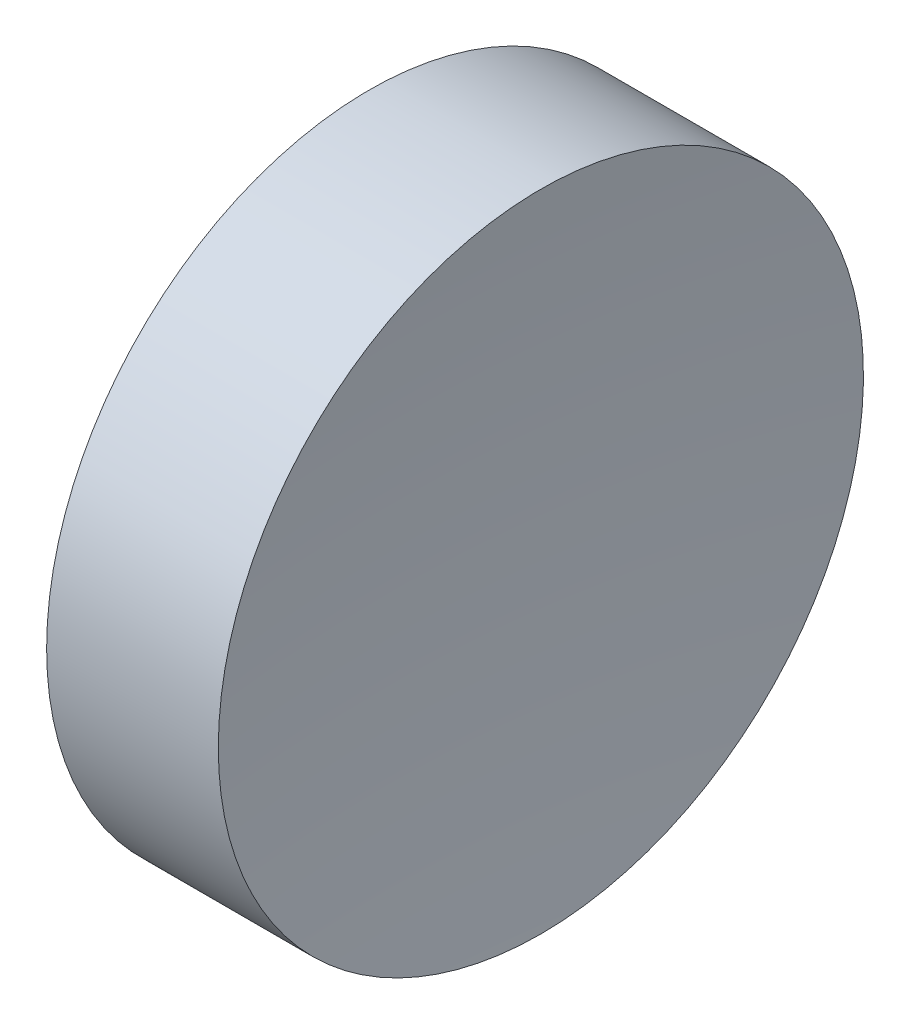
ISO-10303-21;
HEADER;
FILE_DESCRIPTION(('STEP AP214'),'2;1');
FILE_NAME('part.step','',(''),(''),'','','');
FILE_SCHEMA(('AUTOMOTIVE_DESIGN { 1 0 10303 214 1 1 1 1 }'));
ENDSEC;
DATA;
#1=APPLICATION_CONTEXT('core data for automotive mechanical design processes');
#2=APPLICATION_PROTOCOL_DEFINITION('international standard','automotive_design',2000,#1);
#3=PRODUCT_CONTEXT('',#1,'mechanical');
#4=PRODUCT('Part','Part','',(#3));
#5=PRODUCT_RELATED_PRODUCT_CATEGORY('part','',(#4));
#6=PRODUCT_DEFINITION_FORMATION('','',#4);
#7=PRODUCT_DEFINITION_CONTEXT('part definition',#1,'design');
#8=PRODUCT_DEFINITION('design','',#6,#7);
#9=PRODUCT_DEFINITION_SHAPE('','',#8);
#10=(LENGTH_UNIT() NAMED_UNIT(*) SI_UNIT(.MILLI.,.METRE.));
#11=(NAMED_UNIT(*) PLANE_ANGLE_UNIT() SI_UNIT($,.RADIAN.));
#12=(NAMED_UNIT(*) SI_UNIT($,.STERADIAN.) SOLID_ANGLE_UNIT());
#13=UNCERTAINTY_MEASURE_WITH_UNIT(LENGTH_MEASURE(1.E-05),#10,'distance_accuracy_value','');
#14=(GEOMETRIC_REPRESENTATION_CONTEXT(3) GLOBAL_UNCERTAINTY_ASSIGNED_CONTEXT((#13)) GLOBAL_UNIT_ASSIGNED_CONTEXT((#10,
#11,#12)) REPRESENTATION_CONTEXT('',''));
#15=CARTESIAN_POINT('',(0.,0.,0.));
#16=DIRECTION('',(0.,0.,1.));
#17=DIRECTION('',(1.,0.,0.));
#18=AXIS2_PLACEMENT_3D('',#15,#16,#17);
#19=CARTESIAN_POINT('',(120.546327601967,34.6890105616862,0.));
#20=DIRECTION('',(-1.,0.,0.));
#21=DIRECTION('',(0.,-1.,0.));
#22=AXIS2_PLACEMENT_3D('',#19,#20,#21);
#23=SPHERICAL_SURFACE('',#22,60.);
#24=CARTESIAN_POINT('',(60.872736290567,34.6890105616862,0.));
#25=DIRECTION('',(-1.,0.,0.));
#26=DIRECTION('',(0.,0.,1.));
#27=AXIS2_PLACEMENT_3D('',#24,#25,#26);
#28=CIRCLE('',#27,6.25000000000001);
#29=CARTESIAN_POINT('',(60.872736290567,34.6890105616862,6.25000000000001));
#30=VERTEX_POINT('',#29);
#31=EDGE_CURVE('E10',#30,#30,#28,.T.);
#32=ORIENTED_EDGE('',*,*,#31,.F.);
#33=EDGE_LOOP('',(#32));
#34=FACE_BOUND('',#33,.T.);
#35=ADVANCED_FACE('F35',(#34),#23,.F.);
#36=CARTESIAN_POINT('',(54.4925715010826,34.6890105616862,0.));
#37=DIRECTION('',(-1.,0.,0.));
#38=DIRECTION('',(0.,0.,1.));
#39=AXIS2_PLACEMENT_3D('',#36,#37,#38);
#40=CYLINDRICAL_SURFACE('',#39,6.25000000000001);
#41=CARTESIAN_POINT('',(57.5463277674598,34.6890105616862,0.));
#42=DIRECTION('',(-1.,0.,0.));
#43=DIRECTION('',(0.,0.,1.));
#44=AXIS2_PLACEMENT_3D('',#41,#42,#43);
#45=CIRCLE('',#44,6.25);
#46=CARTESIAN_POINT('',(57.5463277674598,34.6890105616862,6.25));
#47=VERTEX_POINT('',#46);
#48=EDGE_CURVE('E41',#47,#47,#45,.T.);
#49=ORIENTED_EDGE('',*,*,#48,.F.);
#50=EDGE_LOOP('',(#49));
#51=FACE_BOUND('',#50,.T.);
#52=ORIENTED_EDGE('',*,*,#31,.T.);
#53=EDGE_LOOP('',(#52));
#54=FACE_BOUND('',#53,.T.);
#55=ADVANCED_FACE('F49',(#51,#54),#40,.T.);
#56=CARTESIAN_POINT('',(57.5463277674598,34.6890105616862,0.));
#57=DIRECTION('',(1.,0.,0.));
#58=DIRECTION('',(0.,0.,-1.));
#59=AXIS2_PLACEMENT_3D('',#56,#57,#58);
#60=PLANE('',#59);
#61=ORIENTED_EDGE('',*,*,#48,.T.);
#62=EDGE_LOOP('',(#61));
#63=FACE_BOUND('',#62,.T.);
#64=ADVANCED_FACE('F47',(#63),#60,.F.);
#65=CLOSED_SHELL('',(#35,#55,#64));
#66=MANIFOLD_SOLID_BREP('B2',#65);
#67=ADVANCED_BREP_SHAPE_REPRESENTATION('',(#18,#66),#14);
#68=SHAPE_DEFINITION_REPRESENTATION(#9,#67);
ENDSEC;
END-ISO-10303-21;
